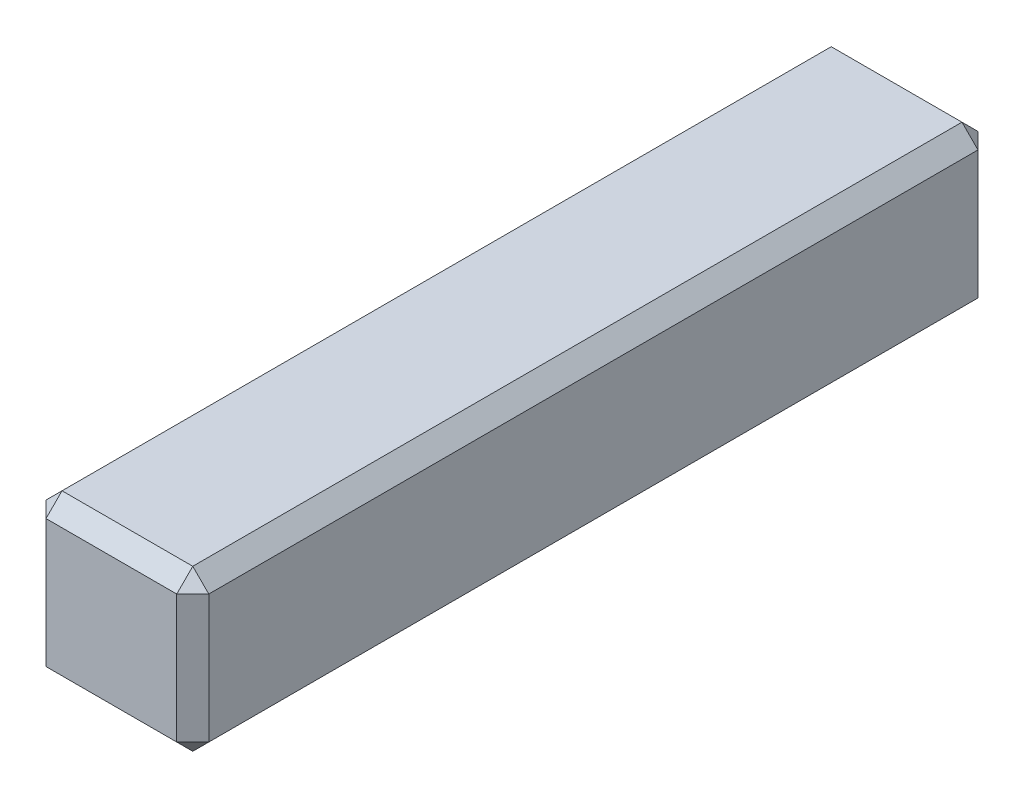
ISO-10303-21;
HEADER;
FILE_DESCRIPTION(('STEP AP214'),'2;1');
FILE_NAME('part.step','',(''),(''),'','','');
FILE_SCHEMA(('AUTOMOTIVE_DESIGN { 1 0 10303 214 1 1 1 1 }'));
ENDSEC;
DATA;
#1=APPLICATION_CONTEXT('core data for automotive mechanical design processes');
#2=APPLICATION_PROTOCOL_DEFINITION('international standard','automotive_design',2000,#1);
#3=PRODUCT_CONTEXT('',#1,'mechanical');
#4=PRODUCT('Part','Part','',(#3));
#5=PRODUCT_RELATED_PRODUCT_CATEGORY('part','',(#4));
#6=PRODUCT_DEFINITION_FORMATION('','',#4);
#7=PRODUCT_DEFINITION_CONTEXT('part definition',#1,'design');
#8=PRODUCT_DEFINITION('design','',#6,#7);
#9=PRODUCT_DEFINITION_SHAPE('','',#8);
#10=(LENGTH_UNIT() NAMED_UNIT(*) SI_UNIT(.MILLI.,.METRE.));
#11=(NAMED_UNIT(*) PLANE_ANGLE_UNIT() SI_UNIT($,.RADIAN.));
#12=(NAMED_UNIT(*) SI_UNIT($,.STERADIAN.) SOLID_ANGLE_UNIT());
#13=UNCERTAINTY_MEASURE_WITH_UNIT(LENGTH_MEASURE(1.E-05),#10,'distance_accuracy_value','');
#14=(GEOMETRIC_REPRESENTATION_CONTEXT(3) GLOBAL_UNCERTAINTY_ASSIGNED_CONTEXT((#13)) GLOBAL_UNIT_ASSIGNED_CONTEXT((#10,
#11,#12)) REPRESENTATION_CONTEXT('',''));
#15=CARTESIAN_POINT('',(0.,0.,0.));
#16=DIRECTION('',(0.,0.,1.));
#17=DIRECTION('',(1.,0.,0.));
#18=AXIS2_PLACEMENT_3D('',#15,#16,#17);
#19=CARTESIAN_POINT('',(-49.1892541944287,13.5530588779456,5.));
#20=DIRECTION('',(0.,-1.,0.));
#21=DIRECTION('',(0.,0.,-1.));
#22=AXIS2_PLACEMENT_3D('',#19,#20,#21);
#23=PLANE('',#22);
#24=DIRECTION('',(0.,0.,-1.));
#25=VECTOR('',#24,1.);
#26=CARTESIAN_POINT('',(-49.3892541944287,13.5530588779456,-5.));
#27=LINE('',#26,#25);
#28=CARTESIAN_POINT('',(-49.3892541944287,13.5530588779456,4.8));
#29=VERTEX_POINT('',#28);
#30=CARTESIAN_POINT('',(-49.3892541944287,13.5530588779456,-4.8));
#31=VERTEX_POINT('',#30);
#32=EDGE_CURVE('E178',#29,#31,#27,.T.);
#33=ORIENTED_EDGE('',*,*,#32,.T.);
#34=DIRECTION('',(-1.,0.,0.));
#35=VECTOR('',#34,1.);
#36=CARTESIAN_POINT('',(-49.1892541944287,13.5530588779456,-4.8));
#37=LINE('',#36,#35);
#38=CARTESIAN_POINT('',(-51.0210083578769,13.5530588779456,-4.8));
#39=VERTEX_POINT('',#38);
#40=EDGE_CURVE('E180',#31,#39,#37,.T.);
#41=ORIENTED_EDGE('',*,*,#40,.T.);
#42=DIRECTION('',(0.,0.,1.));
#43=VECTOR('',#42,1.);
#44=CARTESIAN_POINT('',(-51.0210083578769,13.5530588779456,5.));
#45=LINE('',#44,#43);
#46=CARTESIAN_POINT('',(-51.0210083578769,13.5530588779456,4.8));
#47=VERTEX_POINT('',#46);
#48=EDGE_CURVE('E174',#39,#47,#45,.T.);
#49=ORIENTED_EDGE('',*,*,#48,.T.);
#50=DIRECTION('',(1.,0.,0.));
#51=VECTOR('',#50,1.);
#52=CARTESIAN_POINT('',(-49.1892541944287,13.5530588779456,4.8));
#53=LINE('',#52,#51);
#54=EDGE_CURVE('E176',#47,#29,#53,.T.);
#55=ORIENTED_EDGE('',*,*,#54,.T.);
#56=EDGE_LOOP('',(#33,#41,#49,#55));
#57=FACE_BOUND('',#56,.T.);
#58=ADVANCED_FACE('F33',(#57),#23,.F.);
#59=CARTESIAN_POINT('',(-51.2210083578769,13.5530588779456,5.));
#60=DIRECTION('',(1.,0.,0.));
#61=DIRECTION('',(0.,0.,-1.));
#62=AXIS2_PLACEMENT_3D('',#59,#60,#61);
#63=PLANE('',#62);
#64=DIRECTION('',(0.,0.,-1.));
#65=VECTOR('',#64,1.);
#66=CARTESIAN_POINT('',(-51.2210083578769,13.3530588779456,5.));
#67=LINE('',#66,#65);
#68=CARTESIAN_POINT('',(-51.2210083578769,13.3530588779456,4.8));
#69=VERTEX_POINT('',#68);
#70=CARTESIAN_POINT('',(-51.2210083578769,13.3530588779456,-4.8));
#71=VERTEX_POINT('',#70);
#72=EDGE_CURVE('E200',#69,#71,#67,.T.);
#73=ORIENTED_EDGE('',*,*,#72,.T.);
#74=DIRECTION('',(0.,-1.,0.));
#75=VECTOR('',#74,1.);
#76=CARTESIAN_POINT('',(-51.2210083578769,13.5530588779456,-4.8));
#77=LINE('',#76,#75);
#78=CARTESIAN_POINT('',(-51.2210083578769,11.7530588779456,-4.8));
#79=VERTEX_POINT('',#78);
#80=EDGE_CURVE('E11',#71,#79,#77,.T.);
#81=ORIENTED_EDGE('',*,*,#80,.T.);
#82=DIRECTION('',(0.,0.,1.));
#83=VECTOR('',#82,1.);
#84=CARTESIAN_POINT('',(-51.2210083578769,11.7530588779456,5.));
#85=LINE('',#84,#83);
#86=CARTESIAN_POINT('',(-51.2210083578769,11.7530588779456,4.8));
#87=VERTEX_POINT('',#86);
#88=EDGE_CURVE('E42',#79,#87,#85,.T.);
#89=ORIENTED_EDGE('',*,*,#88,.T.);
#90=DIRECTION('',(0.,1.,0.));
#91=VECTOR('',#90,1.);
#92=CARTESIAN_POINT('',(-51.2210083578769,13.5530588779456,4.8));
#93=LINE('',#92,#91);
#94=EDGE_CURVE('E202',#87,#69,#93,.T.);
#95=ORIENTED_EDGE('',*,*,#94,.T.);
#96=EDGE_LOOP('',(#73,#81,#89,#95));
#97=FACE_BOUND('',#96,.T.);
#98=ADVANCED_FACE('F267',(#97),#63,.F.);
#99=CARTESIAN_POINT('',(-49.1892541944287,11.5530588779456,5.));
#100=DIRECTION('',(0.,-1.,0.));
#101=DIRECTION('',(0.,0.,-1.));
#102=AXIS2_PLACEMENT_3D('',#99,#100,#101);
#103=PLANE('',#102);
#104=DIRECTION('',(-1.,0.,0.));
#105=VECTOR('',#104,1.);
#106=CARTESIAN_POINT('',(-49.1892541944287,11.5530588779456,4.8));
#107=LINE('',#106,#105);
#108=CARTESIAN_POINT('',(-49.3892541944287,11.5530588779456,4.8));
#109=VERTEX_POINT('',#108);
#110=CARTESIAN_POINT('',(-51.0210083578769,11.5530588779456,4.8));
#111=VERTEX_POINT('',#110);
#112=EDGE_CURVE('E133',#109,#111,#107,.T.);
#113=ORIENTED_EDGE('',*,*,#112,.T.);
#114=DIRECTION('',(0.,0.,-1.));
#115=VECTOR('',#114,1.);
#116=CARTESIAN_POINT('',(-51.0210083578769,11.5530588779456,-5.));
#117=LINE('',#116,#115);
#118=CARTESIAN_POINT('',(-51.0210083578769,11.5530588779456,-4.8));
#119=VERTEX_POINT('',#118);
#120=EDGE_CURVE('E129',#111,#119,#117,.T.);
#121=ORIENTED_EDGE('',*,*,#120,.T.);
#122=DIRECTION('',(1.,0.,0.));
#123=VECTOR('',#122,1.);
#124=CARTESIAN_POINT('',(-49.1892541944287,11.5530588779456,-4.8));
#125=LINE('',#124,#123);
#126=CARTESIAN_POINT('',(-49.3892541944287,11.5530588779456,-4.8));
#127=VERTEX_POINT('',#126);
#128=EDGE_CURVE('E121',#119,#127,#125,.T.);
#129=ORIENTED_EDGE('',*,*,#128,.T.);
#130=DIRECTION('',(0.,0.,1.));
#131=VECTOR('',#130,1.);
#132=CARTESIAN_POINT('',(-49.3892541944287,11.5530588779456,5.));
#133=LINE('',#132,#131);
#134=EDGE_CURVE('E126',#127,#109,#133,.T.);
#135=ORIENTED_EDGE('',*,*,#134,.T.);
#136=EDGE_LOOP('',(#113,#121,#129,#135));
#137=FACE_BOUND('',#136,.T.);
#138=ADVANCED_FACE('F124',(#137),#103,.T.);
#139=CARTESIAN_POINT('',(-49.1892541944287,13.5530588779456,5.));
#140=DIRECTION('',(1.,0.,0.));
#141=DIRECTION('',(0.,0.,-1.));
#142=AXIS2_PLACEMENT_3D('',#139,#140,#141);
#143=PLANE('',#142);
#144=DIRECTION('',(0.,0.,-1.));
#145=VECTOR('',#144,1.);
#146=CARTESIAN_POINT('',(-49.1892541944287,11.7530588779456,5.));
#147=LINE('',#146,#145);
#148=CARTESIAN_POINT('',(-49.1892541944287,11.7530588779456,4.8));
#149=VERTEX_POINT('',#148);
#150=CARTESIAN_POINT('',(-49.1892541944287,11.7530588779456,-4.8));
#151=VERTEX_POINT('',#150);
#152=EDGE_CURVE('E195',#149,#151,#147,.T.);
#153=ORIENTED_EDGE('',*,*,#152,.T.);
#154=DIRECTION('',(0.,1.,0.));
#155=VECTOR('',#154,1.);
#156=CARTESIAN_POINT('',(-49.1892541944287,13.5530588779456,-4.8));
#157=LINE('',#156,#155);
#158=CARTESIAN_POINT('',(-49.1892541944287,13.3530588779456,-4.8));
#159=VERTEX_POINT('',#158);
#160=EDGE_CURVE('E197',#151,#159,#157,.T.);
#161=ORIENTED_EDGE('',*,*,#160,.T.);
#162=DIRECTION('',(0.,0.,1.));
#163=VECTOR('',#162,1.);
#164=CARTESIAN_POINT('',(-49.1892541944287,13.3530588779456,5.));
#165=LINE('',#164,#163);
#166=CARTESIAN_POINT('',(-49.1892541944287,13.3530588779456,4.8));
#167=VERTEX_POINT('',#166);
#168=EDGE_CURVE('E191',#159,#167,#165,.T.);
#169=ORIENTED_EDGE('',*,*,#168,.T.);
#170=DIRECTION('',(0.,-1.,0.));
#171=VECTOR('',#170,1.);
#172=CARTESIAN_POINT('',(-49.1892541944287,13.5530588779456,4.8));
#173=LINE('',#172,#171);
#174=EDGE_CURVE('E193',#167,#149,#173,.T.);
#175=ORIENTED_EDGE('',*,*,#174,.T.);
#176=EDGE_LOOP('',(#153,#161,#169,#175));
#177=FACE_BOUND('',#176,.T.);
#178=ADVANCED_FACE('F297',(#177),#143,.T.);
#179=CARTESIAN_POINT('',(0.,0.,5.));
#180=DIRECTION('',(0.,0.,1.));
#181=DIRECTION('',(1.,0.,0.));
#182=AXIS2_PLACEMENT_3D('',#179,#180,#181);
#183=PLANE('',#182);
#184=DIRECTION('',(0.,-1.,0.));
#185=VECTOR('',#184,1.);
#186=CARTESIAN_POINT('',(-51.0210083578769,11.5530588779456,5.));
#187=LINE('',#186,#185);
#188=CARTESIAN_POINT('',(-51.0210083578769,13.3530588779456,5.));
#189=VERTEX_POINT('',#188);
#190=CARTESIAN_POINT('',(-51.0210083578769,11.7530588779456,5.));
#191=VERTEX_POINT('',#190);
#192=EDGE_CURVE('E169',#189,#191,#187,.T.);
#193=ORIENTED_EDGE('',*,*,#192,.T.);
#194=DIRECTION('',(1.,0.,0.));
#195=VECTOR('',#194,1.);
#196=CARTESIAN_POINT('',(0.,11.7530588779456,5.));
#197=LINE('',#196,#195);
#198=CARTESIAN_POINT('',(-49.3892541944287,11.7530588779456,5.));
#199=VERTEX_POINT('',#198);
#200=EDGE_CURVE('E171',#191,#199,#197,.T.);
#201=ORIENTED_EDGE('',*,*,#200,.T.);
#202=DIRECTION('',(0.,1.,0.));
#203=VECTOR('',#202,1.);
#204=CARTESIAN_POINT('',(-49.3892541944287,0.,5.));
#205=LINE('',#204,#203);
#206=CARTESIAN_POINT('',(-49.3892541944287,13.3530588779456,5.));
#207=VERTEX_POINT('',#206);
#208=EDGE_CURVE('E167',#199,#207,#205,.T.);
#209=ORIENTED_EDGE('',*,*,#208,.T.);
#210=DIRECTION('',(-1.,0.,0.));
#211=VECTOR('',#210,1.);
#212=CARTESIAN_POINT('',(-51.2210083578769,13.3530588779456,5.));
#213=LINE('',#212,#211);
#214=EDGE_CURVE('E165',#207,#189,#213,.T.);
#215=ORIENTED_EDGE('',*,*,#214,.T.);
#216=EDGE_LOOP('',(#193,#201,#209,#215));
#217=FACE_BOUND('',#216,.T.);
#218=ADVANCED_FACE('F480',(#217),#183,.T.);
#219=CARTESIAN_POINT('',(0.,0.,-5.));
#220=DIRECTION('',(0.,0.,1.));
#221=DIRECTION('',(1.,0.,0.));
#222=AXIS2_PLACEMENT_3D('',#219,#220,#221);
#223=PLANE('',#222);
#224=DIRECTION('',(0.,1.,0.));
#225=VECTOR('',#224,1.);
#226=CARTESIAN_POINT('',(-51.0210083578769,0.,-5.));
#227=LINE('',#226,#225);
#228=CARTESIAN_POINT('',(-51.0210083578769,11.7530588779456,-5.));
#229=VERTEX_POINT('',#228);
#230=CARTESIAN_POINT('',(-51.0210083578769,13.3530588779456,-5.));
#231=VERTEX_POINT('',#230);
#232=EDGE_CURVE('E183',#229,#231,#227,.T.);
#233=ORIENTED_EDGE('',*,*,#232,.T.);
#234=DIRECTION('',(1.,0.,0.));
#235=VECTOR('',#234,1.);
#236=CARTESIAN_POINT('',(0.,13.3530588779456,-5.));
#237=LINE('',#236,#235);
#238=CARTESIAN_POINT('',(-49.3892541944287,13.3530588779456,-5.));
#239=VERTEX_POINT('',#238);
#240=EDGE_CURVE('E188',#231,#239,#237,.T.);
#241=ORIENTED_EDGE('',*,*,#240,.T.);
#242=DIRECTION('',(0.,-1.,0.));
#243=VECTOR('',#242,1.);
#244=CARTESIAN_POINT('',(-49.3892541944287,11.5530588779456,-5.));
#245=LINE('',#244,#243);
#246=CARTESIAN_POINT('',(-49.3892541944287,11.7530588779456,-5.));
#247=VERTEX_POINT('',#246);
#248=EDGE_CURVE('E186',#239,#247,#245,.T.);
#249=ORIENTED_EDGE('',*,*,#248,.T.);
#250=DIRECTION('',(-1.,0.,0.));
#251=VECTOR('',#250,1.);
#252=CARTESIAN_POINT('',(-51.2210083578769,11.7530588779456,-5.));
#253=LINE('',#252,#251);
#254=EDGE_CURVE('E140',#247,#229,#253,.T.);
#255=ORIENTED_EDGE('',*,*,#254,.T.);
#256=EDGE_LOOP('',(#233,#241,#249,#255));
#257=FACE_BOUND('',#256,.T.);
#258=ADVANCED_FACE('F473',(#257),#223,.F.);
#259=CARTESIAN_POINT('',(-49.1892541944287,13.5530588779456,-4.8));
#260=DIRECTION('',(0.,-0.707106781186551,0.707106781186544));
#261=DIRECTION('',(-1.,0.,0.));
#262=AXIS2_PLACEMENT_3D('',#259,#260,#261);
#263=PLANE('',#262);
#264=DIRECTION('',(0.,-0.707106781186544,-0.707106781186551));
#265=VECTOR('',#264,1.);
#266=CARTESIAN_POINT('',(-49.3892541944287,13.3530588779456,-5.));
#267=LINE('',#266,#265);
#268=EDGE_CURVE('E37',#239,#31,#267,.F.);
#269=ORIENTED_EDGE('',*,*,#268,.F.);
#270=ORIENTED_EDGE('',*,*,#240,.F.);
#271=DIRECTION('',(0.,0.707106781186545,0.707106781186551));
#272=VECTOR('',#271,1.);
#273=CARTESIAN_POINT('',(-51.0210083578769,13.5530588779456,-4.8));
#274=LINE('',#273,#272);
#275=EDGE_CURVE('E161',#39,#231,#274,.F.);
#276=ORIENTED_EDGE('',*,*,#275,.F.);
#277=ORIENTED_EDGE('',*,*,#40,.F.);
#278=EDGE_LOOP('',(#269,#270,#276,#277));
#279=FACE_BOUND('',#278,.T.);
#280=ADVANCED_FACE('F35',(#279),#263,.F.);
#281=CARTESIAN_POINT('',(-49.3892541944287,13.3530588779456,-5.));
#282=DIRECTION('',(0.577350269189624,0.577350269189629,-0.577350269189624));
#283=DIRECTION('',(0.,0.707106781186544,0.707106781186551));
#284=AXIS2_PLACEMENT_3D('',#281,#282,#283);
#285=PLANE('',#284);
#286=DIRECTION('',(-0.707106781186548,0.,-0.707106781186548));
#287=VECTOR('',#286,1.);
#288=CARTESIAN_POINT('',(-49.3892541944287,13.3530588779456,-5.));
#289=LINE('',#288,#287);
#290=EDGE_CURVE('E248',#239,#159,#289,.F.);
#291=ORIENTED_EDGE('',*,*,#290,.F.);
#292=ORIENTED_EDGE('',*,*,#268,.T.);
#293=DIRECTION('',(0.707106781186551,-0.707106781186544,0.));
#294=VECTOR('',#293,1.);
#295=CARTESIAN_POINT('',(-49.2892541944287,13.4530588779456,-4.8));
#296=LINE('',#295,#294);
#297=EDGE_CURVE('E251',#159,#31,#296,.F.);
#298=ORIENTED_EDGE('',*,*,#297,.F.);
#299=EDGE_LOOP('',(#291,#292,#298));
#300=FACE_BOUND('',#299,.T.);
#301=ADVANCED_FACE('F292',(#300),#285,.T.);
#302=CARTESIAN_POINT('',(-51.0210083578769,13.5530588779456,-4.8));
#303=DIRECTION('',(-0.577350269189621,0.577350269189631,-0.577350269189626));
#304=DIRECTION('',(0.,0.707106781186544,0.707106781186551));
#305=AXIS2_PLACEMENT_3D('',#302,#303,#304);
#306=PLANE('',#305);
#307=DIRECTION('',(-0.707106781186551,-0.707106781186544,0.));
#308=VECTOR('',#307,1.);
#309=CARTESIAN_POINT('',(-51.0210083578769,13.5530588779456,-4.8));
#310=LINE('',#309,#308);
#311=EDGE_CURVE('E242',#39,#71,#310,.T.);
#312=ORIENTED_EDGE('',*,*,#311,.F.);
#313=ORIENTED_EDGE('',*,*,#275,.T.);
#314=DIRECTION('',(0.707106781186551,0.,-0.707106781186544));
#315=VECTOR('',#314,1.);
#316=CARTESIAN_POINT('',(-51.1210083578769,13.3530588779456,-4.9));
#317=LINE('',#316,#315);
#318=EDGE_CURVE('E245',#71,#231,#317,.T.);
#319=ORIENTED_EDGE('',*,*,#318,.F.);
#320=EDGE_LOOP('',(#312,#313,#319));
#321=FACE_BOUND('',#320,.T.);
#322=ADVANCED_FACE('F258',(#321),#306,.T.);
#323=CARTESIAN_POINT('',(-49.3892541944287,13.5530588779456,5.));
#324=DIRECTION('',(0.707106781186544,0.707106781186551,0.));
#325=DIRECTION('',(0.,0.,1.));
#326=AXIS2_PLACEMENT_3D('',#323,#324,#325);
#327=PLANE('',#326);
#328=ORIENTED_EDGE('',*,*,#297,.T.);
#329=ORIENTED_EDGE('',*,*,#32,.F.);
#330=DIRECTION('',(-0.707106781186551,0.707106781186544,0.));
#331=VECTOR('',#330,1.);
#332=CARTESIAN_POINT('',(-49.2892541944287,13.4530588779456,4.8));
#333=LINE('',#332,#331);
#334=EDGE_CURVE('E236',#167,#29,#333,.T.);
#335=ORIENTED_EDGE('',*,*,#334,.F.);
#336=ORIENTED_EDGE('',*,*,#168,.F.);
#337=EDGE_LOOP('',(#328,#329,#335,#336));
#338=FACE_BOUND('',#337,.T.);
#339=ADVANCED_FACE('F287',(#338),#327,.T.);
#340=CARTESIAN_POINT('',(-49.3892541944287,0.,-5.));
#341=DIRECTION('',(0.707106781186548,0.,-0.707106781186548));
#342=DIRECTION('',(0.,1.,0.));
#343=AXIS2_PLACEMENT_3D('',#340,#341,#342);
#344=PLANE('',#343);
#345=ORIENTED_EDGE('',*,*,#290,.T.);
#346=ORIENTED_EDGE('',*,*,#160,.F.);
#347=DIRECTION('',(0.707106781186548,0.,0.707106781186548));
#348=VECTOR('',#347,1.);
#349=CARTESIAN_POINT('',(-49.3892541944287,11.7530588779456,-5.));
#350=LINE('',#349,#348);
#351=EDGE_CURVE('E144',#247,#151,#350,.T.);
#352=ORIENTED_EDGE('',*,*,#351,.F.);
#353=ORIENTED_EDGE('',*,*,#248,.F.);
#354=EDGE_LOOP('',(#345,#346,#352,#353));
#355=FACE_BOUND('',#354,.T.);
#356=ADVANCED_FACE('F295',(#355),#344,.T.);
#357=CARTESIAN_POINT('',(0.,11.7530588779456,-5.));
#358=DIRECTION('',(0.,-0.707106781186551,-0.707106781186544));
#359=DIRECTION('',(1.,0.,0.));
#360=AXIS2_PLACEMENT_3D('',#357,#358,#359);
#361=PLANE('',#360);
#362=DIRECTION('',(0.,-0.707106781186545,0.707106781186551));
#363=VECTOR('',#362,1.);
#364=CARTESIAN_POINT('',(-51.0210083578769,11.7530588779456,-5.));
#365=LINE('',#364,#363);
#366=EDGE_CURVE('E145',#229,#119,#365,.T.);
#367=ORIENTED_EDGE('',*,*,#366,.F.);
#368=ORIENTED_EDGE('',*,*,#254,.F.);
#369=DIRECTION('',(0.,0.707106781186544,-0.707106781186551));
#370=VECTOR('',#369,1.);
#371=CARTESIAN_POINT('',(-49.3892541944287,11.7530588779456,-5.));
#372=LINE('',#371,#370);
#373=EDGE_CURVE('E137',#127,#247,#372,.T.);
#374=ORIENTED_EDGE('',*,*,#373,.F.);
#375=ORIENTED_EDGE('',*,*,#128,.F.);
#376=EDGE_LOOP('',(#367,#368,#374,#375));
#377=FACE_BOUND('',#376,.T.);
#378=ADVANCED_FACE('F139',(#377),#361,.T.);
#379=CARTESIAN_POINT('',(-51.2210083578769,13.5530588779456,-4.8));
#380=DIRECTION('',(0.707106781186544,0.,0.707106781186551));
#381=DIRECTION('',(0.,-1.,0.));
#382=AXIS2_PLACEMENT_3D('',#379,#380,#381);
#383=PLANE('',#382);
#384=ORIENTED_EDGE('',*,*,#318,.T.);
#385=ORIENTED_EDGE('',*,*,#232,.F.);
#386=DIRECTION('',(-0.707106781186551,0.,0.707106781186544));
#387=VECTOR('',#386,1.);
#388=CARTESIAN_POINT('',(-51.0210083578769,11.7530588779456,-5.));
#389=LINE('',#388,#387);
#390=EDGE_CURVE('E231',#79,#229,#389,.F.);
#391=ORIENTED_EDGE('',*,*,#390,.F.);
#392=ORIENTED_EDGE('',*,*,#80,.F.);
#393=EDGE_LOOP('',(#384,#385,#391,#392));
#394=FACE_BOUND('',#393,.T.);
#395=ADVANCED_FACE('F265',(#394),#383,.F.);
#396=CARTESIAN_POINT('',(-51.2210083578769,13.3530588779456,5.));
#397=DIRECTION('',(0.707106781186544,-0.707106781186551,0.));
#398=DIRECTION('',(0.,0.,-1.));
#399=AXIS2_PLACEMENT_3D('',#396,#397,#398);
#400=PLANE('',#399);
#401=ORIENTED_EDGE('',*,*,#311,.T.);
#402=ORIENTED_EDGE('',*,*,#72,.F.);
#403=DIRECTION('',(0.707106781186551,0.707106781186544,0.));
#404=VECTOR('',#403,1.);
#405=CARTESIAN_POINT('',(-51.2210083578769,13.3530588779456,4.8));
#406=LINE('',#405,#404);
#407=EDGE_CURVE('E228',#47,#69,#406,.F.);
#408=ORIENTED_EDGE('',*,*,#407,.F.);
#409=ORIENTED_EDGE('',*,*,#48,.F.);
#410=EDGE_LOOP('',(#401,#402,#408,#409));
#411=FACE_BOUND('',#410,.T.);
#412=ADVANCED_FACE('F271',(#411),#400,.F.);
#413=CARTESIAN_POINT('',(0.,13.3530588779456,5.));
#414=DIRECTION('',(0.,0.707106781186551,0.707106781186544));
#415=DIRECTION('',(1.,0.,0.));
#416=AXIS2_PLACEMENT_3D('',#413,#414,#415);
#417=PLANE('',#416);
#418=DIRECTION('',(0.,-0.707106781186545,0.707106781186551));
#419=VECTOR('',#418,1.);
#420=CARTESIAN_POINT('',(-49.3892541944287,13.3530588779456,5.));
#421=LINE('',#420,#419);
#422=EDGE_CURVE('E239',#29,#207,#421,.T.);
#423=ORIENTED_EDGE('',*,*,#422,.F.);
#424=ORIENTED_EDGE('',*,*,#54,.F.);
#425=DIRECTION('',(0.,0.707106781186545,-0.707106781186551));
#426=VECTOR('',#425,1.);
#427=CARTESIAN_POINT('',(-51.0210083578769,13.4530588779456,4.9));
#428=LINE('',#427,#426);
#429=EDGE_CURVE('E225',#189,#47,#428,.T.);
#430=ORIENTED_EDGE('',*,*,#429,.F.);
#431=ORIENTED_EDGE('',*,*,#214,.F.);
#432=EDGE_LOOP('',(#423,#424,#430,#431));
#433=FACE_BOUND('',#432,.T.);
#434=ADVANCED_FACE('F278',(#433),#417,.T.);
#435=CARTESIAN_POINT('',(-49.3892541944287,13.3530588779456,5.));
#436=DIRECTION('',(0.577350269189621,0.577350269189631,0.577350269189626));
#437=DIRECTION('',(0.,-0.707106781186544,0.707106781186551));
#438=AXIS2_PLACEMENT_3D('',#435,#436,#437);
#439=PLANE('',#438);
#440=ORIENTED_EDGE('',*,*,#334,.T.);
#441=ORIENTED_EDGE('',*,*,#422,.T.);
#442=DIRECTION('',(-0.707106781186551,0.,0.707106781186544));
#443=VECTOR('',#442,1.);
#444=CARTESIAN_POINT('',(-49.3892541944287,13.3530588779456,5.));
#445=LINE('',#444,#443);
#446=EDGE_CURVE('E152',#167,#207,#445,.T.);
#447=ORIENTED_EDGE('',*,*,#446,.F.);
#448=EDGE_LOOP('',(#440,#441,#447));
#449=FACE_BOUND('',#448,.T.);
#450=ADVANCED_FACE('F284',(#449),#439,.T.);
#451=CARTESIAN_POINT('',(-49.3892541944287,11.7530588779456,-5.));
#452=DIRECTION('',(0.577350269189624,-0.577350269189629,-0.577350269189624));
#453=DIRECTION('',(0.,0.707106781186544,-0.707106781186551));
#454=AXIS2_PLACEMENT_3D('',#451,#452,#453);
#455=PLANE('',#454);
#456=ORIENTED_EDGE('',*,*,#373,.T.);
#457=ORIENTED_EDGE('',*,*,#351,.T.);
#458=DIRECTION('',(0.707106781186551,0.707106781186544,0.));
#459=VECTOR('',#458,1.);
#460=CARTESIAN_POINT('',(-49.2892541944287,11.6530588779456,-4.8));
#461=LINE('',#460,#459);
#462=EDGE_CURVE('E148',#127,#151,#461,.T.);
#463=ORIENTED_EDGE('',*,*,#462,.F.);
#464=EDGE_LOOP('',(#456,#457,#463));
#465=FACE_BOUND('',#464,.T.);
#466=ADVANCED_FACE('F149',(#465),#455,.T.);
#467=CARTESIAN_POINT('',(-51.0210083578769,11.7530588779456,-5.));
#468=DIRECTION('',(-0.577350269189621,-0.577350269189631,-0.577350269189626));
#469=DIRECTION('',(0.,0.707106781186544,-0.707106781186551));
#470=AXIS2_PLACEMENT_3D('',#467,#468,#469);
#471=PLANE('',#470);
#472=ORIENTED_EDGE('',*,*,#390,.T.);
#473=ORIENTED_EDGE('',*,*,#366,.T.);
#474=DIRECTION('',(-0.707106781186551,0.707106781186544,0.));
#475=VECTOR('',#474,1.);
#476=CARTESIAN_POINT('',(-51.1210083578769,11.6530588779456,-4.8));
#477=LINE('',#476,#475);
#478=EDGE_CURVE('E153',#79,#119,#477,.F.);
#479=ORIENTED_EDGE('',*,*,#478,.F.);
#480=EDGE_LOOP('',(#472,#473,#479));
#481=FACE_BOUND('',#480,.T.);
#482=ADVANCED_FACE('F314',(#481),#471,.T.);
#483=CARTESIAN_POINT('',(-51.2210083578769,13.3530588779456,4.8));
#484=DIRECTION('',(-0.577350269189621,0.577350269189631,0.577350269189626));
#485=DIRECTION('',(0.,-0.707106781186544,0.70710678118655));
#486=AXIS2_PLACEMENT_3D('',#483,#484,#485);
#487=PLANE('',#486);
#488=ORIENTED_EDGE('',*,*,#429,.T.);
#489=ORIENTED_EDGE('',*,*,#407,.T.);
#490=DIRECTION('',(0.707106781186551,0.,0.707106781186544));
#491=VECTOR('',#490,1.);
#492=CARTESIAN_POINT('',(-51.2210083578769,13.3530588779456,4.8));
#493=LINE('',#492,#491);
#494=EDGE_CURVE('E219',#189,#69,#493,.F.);
#495=ORIENTED_EDGE('',*,*,#494,.F.);
#496=EDGE_LOOP('',(#488,#489,#495));
#497=FACE_BOUND('',#496,.T.);
#498=ADVANCED_FACE('F316',(#497),#487,.T.);
#499=CARTESIAN_POINT('',(-49.1892541944287,13.5530588779456,4.8));
#500=DIRECTION('',(-0.707106781186544,0.,-0.707106781186551));
#501=DIRECTION('',(0.,-1.,0.));
#502=AXIS2_PLACEMENT_3D('',#499,#500,#501);
#503=PLANE('',#502);
#504=ORIENTED_EDGE('',*,*,#446,.T.);
#505=ORIENTED_EDGE('',*,*,#208,.F.);
#506=DIRECTION('',(0.707106781186551,0.,-0.707106781186544));
#507=VECTOR('',#506,1.);
#508=CARTESIAN_POINT('',(-49.3892541944287,11.7530588779456,5.));
#509=LINE('',#508,#507);
#510=EDGE_CURVE('E216',#149,#199,#509,.F.);
#511=ORIENTED_EDGE('',*,*,#510,.F.);
#512=ORIENTED_EDGE('',*,*,#174,.F.);
#513=EDGE_LOOP('',(#504,#505,#511,#512));
#514=FACE_BOUND('',#513,.T.);
#515=ADVANCED_FACE('F301',(#514),#503,.F.);
#516=CARTESIAN_POINT('',(-49.1892541944287,11.7530588779456,5.));
#517=DIRECTION('',(-0.707106781186544,0.707106781186551,0.));
#518=DIRECTION('',(0.,0.,-1.));
#519=AXIS2_PLACEMENT_3D('',#516,#517,#518);
#520=PLANE('',#519);
#521=ORIENTED_EDGE('',*,*,#462,.T.);
#522=ORIENTED_EDGE('',*,*,#152,.F.);
#523=DIRECTION('',(-0.707106781186551,-0.707106781186544,0.));
#524=VECTOR('',#523,1.);
#525=CARTESIAN_POINT('',(-49.2892541944287,11.6530588779456,4.8));
#526=LINE('',#525,#524);
#527=EDGE_CURVE('E157',#109,#149,#526,.F.);
#528=ORIENTED_EDGE('',*,*,#527,.F.);
#529=ORIENTED_EDGE('',*,*,#134,.F.);
#530=EDGE_LOOP('',(#521,#522,#528,#529));
#531=FACE_BOUND('',#530,.T.);
#532=ADVANCED_FACE('F155',(#531),#520,.F.);
#533=CARTESIAN_POINT('',(-51.0210083578769,11.5530588779456,5.));
#534=DIRECTION('',(-0.707106781186544,-0.707106781186551,0.));
#535=DIRECTION('',(0.,0.,1.));
#536=AXIS2_PLACEMENT_3D('',#533,#534,#535);
#537=PLANE('',#536);
#538=ORIENTED_EDGE('',*,*,#478,.T.);
#539=ORIENTED_EDGE('',*,*,#120,.F.);
#540=DIRECTION('',(0.707106781186551,-0.707106781186544,0.));
#541=VECTOR('',#540,1.);
#542=CARTESIAN_POINT('',(-51.0210083578769,11.5530588779456,4.8));
#543=LINE('',#542,#541);
#544=EDGE_CURVE('E212',#87,#111,#543,.T.);
#545=ORIENTED_EDGE('',*,*,#544,.F.);
#546=ORIENTED_EDGE('',*,*,#88,.F.);
#547=EDGE_LOOP('',(#538,#539,#545,#546));
#548=FACE_BOUND('',#547,.T.);
#549=ADVANCED_FACE('F312',(#548),#537,.T.);
#550=CARTESIAN_POINT('',(-51.0210083578769,0.,5.));
#551=DIRECTION('',(-0.707106781186544,0.,0.707106781186551));
#552=DIRECTION('',(0.,1.,0.));
#553=AXIS2_PLACEMENT_3D('',#550,#551,#552);
#554=PLANE('',#553);
#555=ORIENTED_EDGE('',*,*,#494,.T.);
#556=ORIENTED_EDGE('',*,*,#94,.F.);
#557=DIRECTION('',(-0.707106781186551,0.,-0.707106781186544));
#558=VECTOR('',#557,1.);
#559=CARTESIAN_POINT('',(-51.1210083578769,11.7530588779456,4.9));
#560=LINE('',#559,#558);
#561=EDGE_CURVE('E209',#191,#87,#560,.T.);
#562=ORIENTED_EDGE('',*,*,#561,.F.);
#563=ORIENTED_EDGE('',*,*,#192,.F.);
#564=EDGE_LOOP('',(#555,#556,#562,#563));
#565=FACE_BOUND('',#564,.T.);
#566=ADVANCED_FACE('F339',(#565),#554,.T.);
#567=CARTESIAN_POINT('',(-49.3892541944287,11.7530588779456,5.));
#568=DIRECTION('',(0.577350269189621,-0.577350269189626,0.577350269189631));
#569=DIRECTION('',(0.,-0.707106781186551,-0.707106781186544));
#570=AXIS2_PLACEMENT_3D('',#567,#568,#569);
#571=PLANE('',#570);
#572=ORIENTED_EDGE('',*,*,#527,.T.);
#573=ORIENTED_EDGE('',*,*,#510,.T.);
#574=DIRECTION('',(0.,0.707106781186551,0.707106781186545));
#575=VECTOR('',#574,1.);
#576=CARTESIAN_POINT('',(-49.3892541944287,11.7530588779456,5.));
#577=LINE('',#576,#575);
#578=EDGE_CURVE('E207',#109,#199,#577,.T.);
#579=ORIENTED_EDGE('',*,*,#578,.F.);
#580=EDGE_LOOP('',(#572,#573,#579));
#581=FACE_BOUND('',#580,.T.);
#582=ADVANCED_FACE('F303',(#581),#571,.T.);
#583=CARTESIAN_POINT('',(-51.0210083578769,11.5530588779456,4.8));
#584=DIRECTION('',(-0.577350269189621,-0.577350269189626,0.577350269189631));
#585=DIRECTION('',(0.,-0.707106781186551,-0.707106781186544));
#586=AXIS2_PLACEMENT_3D('',#583,#584,#585);
#587=PLANE('',#586);
#588=ORIENTED_EDGE('',*,*,#561,.T.);
#589=ORIENTED_EDGE('',*,*,#544,.T.);
#590=DIRECTION('',(0.,-0.707106781186551,-0.707106781186545));
#591=VECTOR('',#590,1.);
#592=CARTESIAN_POINT('',(-51.0210083578769,11.5530588779456,4.8));
#593=LINE('',#592,#591);
#594=EDGE_CURVE('E205',#191,#111,#593,.T.);
#595=ORIENTED_EDGE('',*,*,#594,.F.);
#596=EDGE_LOOP('',(#588,#589,#595));
#597=FACE_BOUND('',#596,.T.);
#598=ADVANCED_FACE('F310',(#597),#587,.T.);
#599=CARTESIAN_POINT('',(-49.1892541944287,11.5530588779456,4.8));
#600=DIRECTION('',(0.,0.707106781186544,-0.707106781186551));
#601=DIRECTION('',(-1.,0.,0.));
#602=AXIS2_PLACEMENT_3D('',#599,#600,#601);
#603=PLANE('',#602);
#604=ORIENTED_EDGE('',*,*,#578,.T.);
#605=ORIENTED_EDGE('',*,*,#200,.F.);
#606=ORIENTED_EDGE('',*,*,#594,.T.);
#607=ORIENTED_EDGE('',*,*,#112,.F.);
#608=EDGE_LOOP('',(#604,#605,#606,#607));
#609=FACE_BOUND('',#608,.T.);
#610=ADVANCED_FACE('F307',(#609),#603,.F.);
#611=CLOSED_SHELL('',(#58,#98,#138,#178,#218,#258,#280,#301,#322,#339,#356,#378,#395,#412,#434,
#450,#466,#482,#498,#515,#532,#549,#566,#582,#598,#610));
#612=MANIFOLD_SOLID_BREP('B2',#611);
#613=ADVANCED_BREP_SHAPE_REPRESENTATION('',(#18,#612),#14);
#614=SHAPE_DEFINITION_REPRESENTATION(#9,#613);
ENDSEC;
END-ISO-10303-21;
